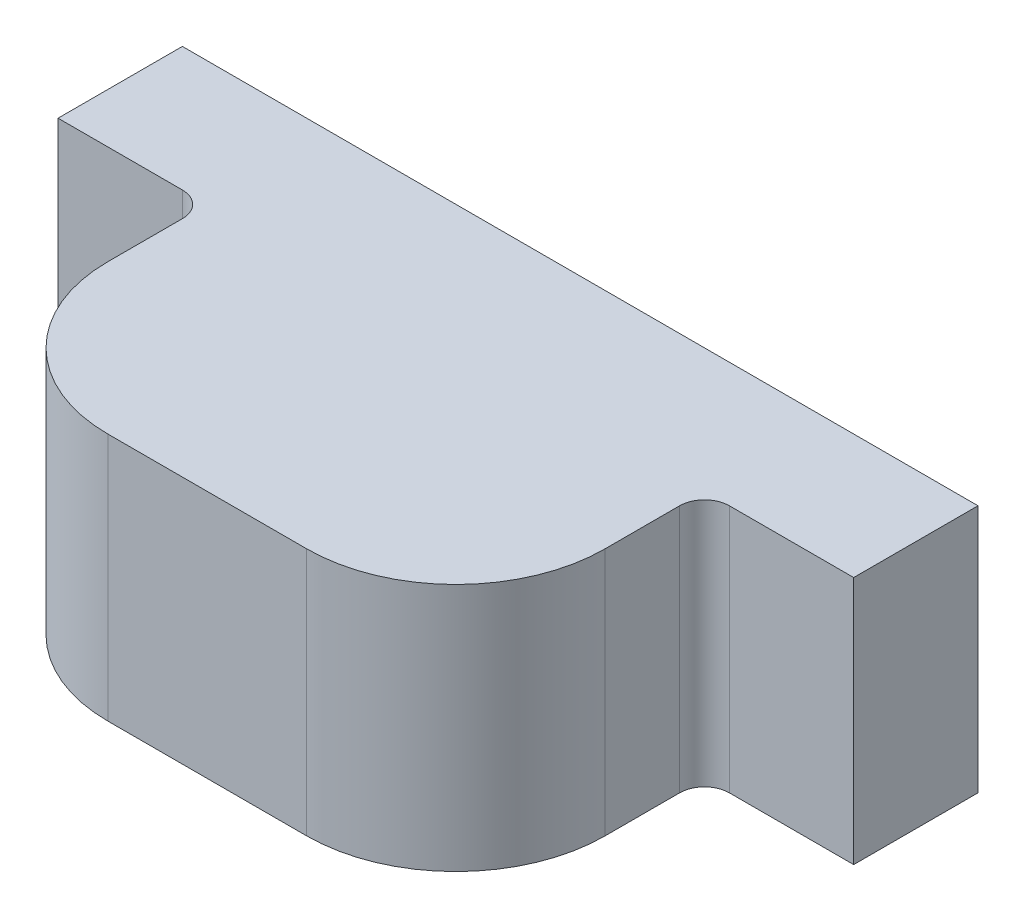
ISO-10303-21;
HEADER;
FILE_DESCRIPTION(('STEP AP214'),'2;1');
FILE_NAME('part.step','',(''),(''),'','','');
FILE_SCHEMA(('AUTOMOTIVE_DESIGN { 1 0 10303 214 1 1 1 1 }'));
ENDSEC;
DATA;
#1=APPLICATION_CONTEXT('core data for automotive mechanical design processes');
#2=APPLICATION_PROTOCOL_DEFINITION('international standard','automotive_design',2000,#1);
#3=PRODUCT_CONTEXT('',#1,'mechanical');
#4=PRODUCT('Part','Part','',(#3));
#5=PRODUCT_RELATED_PRODUCT_CATEGORY('part','',(#4));
#6=PRODUCT_DEFINITION_FORMATION('','',#4);
#7=PRODUCT_DEFINITION_CONTEXT('part definition',#1,'design');
#8=PRODUCT_DEFINITION('design','',#6,#7);
#9=PRODUCT_DEFINITION_SHAPE('','',#8);
#10=(LENGTH_UNIT() NAMED_UNIT(*) SI_UNIT(.MILLI.,.METRE.));
#11=(NAMED_UNIT(*) PLANE_ANGLE_UNIT() SI_UNIT($,.RADIAN.));
#12=(NAMED_UNIT(*) SI_UNIT($,.STERADIAN.) SOLID_ANGLE_UNIT());
#13=UNCERTAINTY_MEASURE_WITH_UNIT(LENGTH_MEASURE(1.E-05),#10,'distance_accuracy_value','');
#14=(GEOMETRIC_REPRESENTATION_CONTEXT(3) GLOBAL_UNCERTAINTY_ASSIGNED_CONTEXT((#13)) GLOBAL_UNIT_ASSIGNED_CONTEXT((#10,
#11,#12)) REPRESENTATION_CONTEXT('',''));
#15=CARTESIAN_POINT('',(0.,0.,0.));
#16=DIRECTION('',(0.,0.,1.));
#17=DIRECTION('',(1.,0.,0.));
#18=AXIS2_PLACEMENT_3D('',#15,#16,#17);
#19=CARTESIAN_POINT('',(-1.6,1.,-0.25));
#20=DIRECTION('',(1.,0.,0.));
#21=DIRECTION('',(0.,0.,-1.));
#22=AXIS2_PLACEMENT_3D('',#19,#20,#21);
#23=PLANE('',#22);
#24=DIRECTION('',(0.,0.,1.));
#25=VECTOR('',#24,1.);
#26=CARTESIAN_POINT('',(-1.6,0.,-0.25));
#27=LINE('',#26,#25);
#28=CARTESIAN_POINT('',(-1.6,0.,-0.25));
#29=VERTEX_POINT('',#28);
#30=CARTESIAN_POINT('',(-1.6,0.,0.25));
#31=VERTEX_POINT('',#30);
#32=EDGE_CURVE('E153',#29,#31,#27,.T.);
#33=ORIENTED_EDGE('',*,*,#32,.T.);
#34=DIRECTION('',(0.,-1.,0.));
#35=VECTOR('',#34,1.);
#36=CARTESIAN_POINT('',(-1.6,1.,0.25));
#37=LINE('',#36,#35);
#38=CARTESIAN_POINT('',(-1.6,1.,0.25));
#39=VERTEX_POINT('',#38);
#40=EDGE_CURVE('E11',#39,#31,#37,.T.);
#41=ORIENTED_EDGE('',*,*,#40,.F.);
#42=DIRECTION('',(0.,0.,1.));
#43=VECTOR('',#42,1.);
#44=CARTESIAN_POINT('',(-1.6,1.,-0.25));
#45=LINE('',#44,#43);
#46=CARTESIAN_POINT('',(-1.6,1.,-0.25));
#47=VERTEX_POINT('',#46);
#48=EDGE_CURVE('E175',#47,#39,#45,.T.);
#49=ORIENTED_EDGE('',*,*,#48,.F.);
#50=DIRECTION('',(0.,-1.,0.));
#51=VECTOR('',#50,1.);
#52=CARTESIAN_POINT('',(-1.6,1.,-0.25));
#53=LINE('',#52,#51);
#54=EDGE_CURVE('E149',#47,#29,#53,.T.);
#55=ORIENTED_EDGE('',*,*,#54,.T.);
#56=EDGE_LOOP('',(#33,#41,#49,#55));
#57=FACE_BOUND('',#56,.T.);
#58=ADVANCED_FACE('F33',(#57),#23,.F.);
#59=CARTESIAN_POINT('',(-1.1,1.,0.25));
#60=DIRECTION('',(0.,0.,-1.));
#61=DIRECTION('',(-1.,0.,0.));
#62=AXIS2_PLACEMENT_3D('',#59,#60,#61);
#63=PLANE('',#62);
#64=DIRECTION('',(1.,0.,0.));
#65=VECTOR('',#64,1.);
#66=CARTESIAN_POINT('',(-1.1,0.,0.25));
#67=LINE('',#66,#65);
#68=CARTESIAN_POINT('',(-1.1,0.,0.25));
#69=VERTEX_POINT('',#68);
#70=EDGE_CURVE('E156',#31,#69,#67,.T.);
#71=ORIENTED_EDGE('',*,*,#70,.T.);
#72=DIRECTION('',(0.,-1.,0.));
#73=VECTOR('',#72,1.);
#74=CARTESIAN_POINT('',(-1.1,1.,0.25));
#75=LINE('',#74,#73);
#76=CARTESIAN_POINT('',(-1.1,1.,0.25));
#77=VERTEX_POINT('',#76);
#78=EDGE_CURVE('E41',#77,#69,#75,.T.);
#79=ORIENTED_EDGE('',*,*,#78,.F.);
#80=DIRECTION('',(1.,0.,0.));
#81=VECTOR('',#80,1.);
#82=CARTESIAN_POINT('',(-1.1,1.,0.25));
#83=LINE('',#82,#81);
#84=EDGE_CURVE('E104',#39,#77,#83,.T.);
#85=ORIENTED_EDGE('',*,*,#84,.F.);
#86=ORIENTED_EDGE('',*,*,#40,.T.);
#87=EDGE_LOOP('',(#71,#79,#85,#86));
#88=FACE_BOUND('',#87,.T.);
#89=ADVANCED_FACE('F253',(#88),#63,.F.);
#90=CARTESIAN_POINT('',(-1.1,1.,0.35));
#91=DIRECTION('',(0.,-1.,0.));
#92=DIRECTION('',(0.,0.,-1.));
#93=AXIS2_PLACEMENT_3D('',#90,#91,#92);
#94=CYLINDRICAL_SURFACE('',#93,0.1);
#95=CARTESIAN_POINT('',(-1.1,0.,0.35));
#96=DIRECTION('',(0.,-1.,0.));
#97=DIRECTION('',(0.,0.,-1.));
#98=AXIS2_PLACEMENT_3D('',#95,#96,#97);
#99=CIRCLE('',#98,0.1);
#100=CARTESIAN_POINT('',(-0.999999999999998,0.,0.350000000000001));
#101=VERTEX_POINT('',#100);
#102=EDGE_CURVE('E158',#69,#101,#99,.T.);
#103=ORIENTED_EDGE('',*,*,#102,.T.);
#104=DIRECTION('',(0.,-1.,0.));
#105=VECTOR('',#104,1.);
#106=CARTESIAN_POINT('',(-0.999999999999998,1.,0.350000000000001));
#107=LINE('',#106,#105);
#108=CARTESIAN_POINT('',(-0.999999999999998,1.,0.350000000000001));
#109=VERTEX_POINT('',#108);
#110=EDGE_CURVE('E194',#109,#101,#107,.T.);
#111=ORIENTED_EDGE('',*,*,#110,.F.);
#112=CARTESIAN_POINT('',(-1.1,1.,0.35));
#113=DIRECTION('',(0.,-1.,0.));
#114=DIRECTION('',(0.,0.,-1.));
#115=AXIS2_PLACEMENT_3D('',#112,#113,#114);
#116=CIRCLE('',#115,0.1);
#117=EDGE_CURVE('E202',#77,#109,#116,.T.);
#118=ORIENTED_EDGE('',*,*,#117,.F.);
#119=ORIENTED_EDGE('',*,*,#78,.T.);
#120=EDGE_LOOP('',(#103,#111,#118,#119));
#121=FACE_BOUND('',#120,.T.);
#122=ADVANCED_FACE('F200',(#121),#94,.F.);
#123=CARTESIAN_POINT('',(-0.999999999999998,1.,0.649999999999996));
#124=DIRECTION('',(1.,0.,0.));
#125=DIRECTION('',(0.,0.,-1.));
#126=AXIS2_PLACEMENT_3D('',#123,#124,#125);
#127=PLANE('',#126);
#128=DIRECTION('',(0.,0.,1.));
#129=VECTOR('',#128,1.);
#130=CARTESIAN_POINT('',(-0.999999999999998,0.,0.649999999999996));
#131=LINE('',#130,#129);
#132=CARTESIAN_POINT('',(-0.999999999999998,0.,0.649999999999996));
#133=VERTEX_POINT('',#132);
#134=EDGE_CURVE('E160',#101,#133,#131,.T.);
#135=ORIENTED_EDGE('',*,*,#134,.T.);
#136=DIRECTION('',(0.,-1.,0.));
#137=VECTOR('',#136,1.);
#138=CARTESIAN_POINT('',(-0.999999999999998,1.,0.649999999999996));
#139=LINE('',#138,#137);
#140=CARTESIAN_POINT('',(-0.999999999999998,1.,0.649999999999996));
#141=VERTEX_POINT('',#140);
#142=EDGE_CURVE('E191',#141,#133,#139,.T.);
#143=ORIENTED_EDGE('',*,*,#142,.F.);
#144=DIRECTION('',(0.,0.,1.));
#145=VECTOR('',#144,1.);
#146=CARTESIAN_POINT('',(-0.999999999999998,1.,0.649999999999996));
#147=LINE('',#146,#145);
#148=EDGE_CURVE('E220',#109,#141,#147,.T.);
#149=ORIENTED_EDGE('',*,*,#148,.F.);
#150=ORIENTED_EDGE('',*,*,#110,.T.);
#151=EDGE_LOOP('',(#135,#143,#149,#150));
#152=FACE_BOUND('',#151,.T.);
#153=ADVANCED_FACE('F211',(#152),#127,.F.);
#154=CARTESIAN_POINT('',(-0.399999999999998,1.,0.65));
#155=DIRECTION('',(0.,-1.,0.));
#156=DIRECTION('',(0.,0.,-1.));
#157=AXIS2_PLACEMENT_3D('',#154,#155,#156);
#158=CYLINDRICAL_SURFACE('',#157,0.6);
#159=CARTESIAN_POINT('',(-0.399999999999998,0.,0.65));
#160=DIRECTION('',(0.,1.,0.));
#161=DIRECTION('',(0.,0.,-1.));
#162=AXIS2_PLACEMENT_3D('',#159,#160,#161);
#163=CIRCLE('',#162,0.6);
#164=CARTESIAN_POINT('',(-0.399999999999994,0.,1.25));
#165=VERTEX_POINT('',#164);
#166=EDGE_CURVE('E162',#133,#165,#163,.T.);
#167=ORIENTED_EDGE('',*,*,#166,.T.);
#168=DIRECTION('',(0.,-1.,0.));
#169=VECTOR('',#168,1.);
#170=CARTESIAN_POINT('',(-0.399999999999994,1.,1.25));
#171=LINE('',#170,#169);
#172=CARTESIAN_POINT('',(-0.399999999999994,1.,1.25));
#173=VERTEX_POINT('',#172);
#174=EDGE_CURVE('E188',#173,#165,#171,.T.);
#175=ORIENTED_EDGE('',*,*,#174,.F.);
#176=CARTESIAN_POINT('',(-0.399999999999998,1.,0.65));
#177=DIRECTION('',(0.,1.,0.));
#178=DIRECTION('',(0.,0.,-1.));
#179=AXIS2_PLACEMENT_3D('',#176,#177,#178);
#180=CIRCLE('',#179,0.6);
#181=EDGE_CURVE('E217',#141,#173,#180,.T.);
#182=ORIENTED_EDGE('',*,*,#181,.F.);
#183=ORIENTED_EDGE('',*,*,#142,.T.);
#184=EDGE_LOOP('',(#167,#175,#182,#183));
#185=FACE_BOUND('',#184,.T.);
#186=ADVANCED_FACE('F215',(#185),#158,.T.);
#187=CARTESIAN_POINT('',(0.399999999999998,1.,1.25));
#188=DIRECTION('',(0.,0.,-1.));
#189=DIRECTION('',(-1.,0.,0.));
#190=AXIS2_PLACEMENT_3D('',#187,#188,#189);
#191=PLANE('',#190);
#192=DIRECTION('',(1.,0.,0.));
#193=VECTOR('',#192,1.);
#194=CARTESIAN_POINT('',(0.399999999999998,0.,1.25));
#195=LINE('',#194,#193);
#196=CARTESIAN_POINT('',(0.399999999999998,0.,1.25));
#197=VERTEX_POINT('',#196);
#198=EDGE_CURVE('E164',#165,#197,#195,.T.);
#199=ORIENTED_EDGE('',*,*,#198,.T.);
#200=DIRECTION('',(0.,-1.,0.));
#201=VECTOR('',#200,1.);
#202=CARTESIAN_POINT('',(0.399999999999998,1.,1.25));
#203=LINE('',#202,#201);
#204=CARTESIAN_POINT('',(0.399999999999998,1.,1.25));
#205=VERTEX_POINT('',#204);
#206=EDGE_CURVE('E185',#205,#197,#203,.T.);
#207=ORIENTED_EDGE('',*,*,#206,.F.);
#208=DIRECTION('',(1.,0.,0.));
#209=VECTOR('',#208,1.);
#210=CARTESIAN_POINT('',(0.399999999999998,1.,1.25));
#211=LINE('',#210,#209);
#212=EDGE_CURVE('E219',#173,#205,#211,.T.);
#213=ORIENTED_EDGE('',*,*,#212,.F.);
#214=ORIENTED_EDGE('',*,*,#174,.T.);
#215=EDGE_LOOP('',(#199,#207,#213,#214));
#216=FACE_BOUND('',#215,.T.);
#217=ADVANCED_FACE('F266',(#216),#191,.F.);
#218=CARTESIAN_POINT('',(0.400000000000002,1.,0.65));
#219=DIRECTION('',(0.,-1.,0.));
#220=DIRECTION('',(0.,0.,-1.));
#221=AXIS2_PLACEMENT_3D('',#218,#219,#220);
#222=CYLINDRICAL_SURFACE('',#221,0.6);
#223=CARTESIAN_POINT('',(0.400000000000002,0.,0.65));
#224=DIRECTION('',(0.,1.,0.));
#225=DIRECTION('',(0.,0.,1.));
#226=AXIS2_PLACEMENT_3D('',#223,#224,#225);
#227=CIRCLE('',#226,0.6);
#228=CARTESIAN_POINT('',(1.,0.,0.649999999999996));
#229=VERTEX_POINT('',#228);
#230=EDGE_CURVE('E166',#197,#229,#227,.T.);
#231=ORIENTED_EDGE('',*,*,#230,.T.);
#232=DIRECTION('',(0.,-1.,0.));
#233=VECTOR('',#232,1.);
#234=CARTESIAN_POINT('',(1.,1.,0.649999999999996));
#235=LINE('',#234,#233);
#236=CARTESIAN_POINT('',(1.,1.,0.649999999999996));
#237=VERTEX_POINT('',#236);
#238=EDGE_CURVE('E182',#237,#229,#235,.T.);
#239=ORIENTED_EDGE('',*,*,#238,.F.);
#240=CARTESIAN_POINT('',(0.400000000000002,1.,0.65));
#241=DIRECTION('',(0.,1.,0.));
#242=DIRECTION('',(0.,0.,1.));
#243=AXIS2_PLACEMENT_3D('',#240,#241,#242);
#244=CIRCLE('',#243,0.6);
#245=EDGE_CURVE('E222',#205,#237,#244,.T.);
#246=ORIENTED_EDGE('',*,*,#245,.F.);
#247=ORIENTED_EDGE('',*,*,#206,.T.);
#248=EDGE_LOOP('',(#231,#239,#246,#247));
#249=FACE_BOUND('',#248,.T.);
#250=ADVANCED_FACE('F269',(#249),#222,.T.);
#251=CARTESIAN_POINT('',(1.,1.,0.649999999999996));
#252=DIRECTION('',(-1.,0.,0.));
#253=DIRECTION('',(0.,0.,1.));
#254=AXIS2_PLACEMENT_3D('',#251,#252,#253);
#255=PLANE('',#254);
#256=DIRECTION('',(0.,0.,-1.));
#257=VECTOR('',#256,1.);
#258=CARTESIAN_POINT('',(1.,0.,0.649999999999996));
#259=LINE('',#258,#257);
#260=CARTESIAN_POINT('',(1.,0.,0.350000000000001));
#261=VERTEX_POINT('',#260);
#262=EDGE_CURVE('E168',#229,#261,#259,.T.);
#263=ORIENTED_EDGE('',*,*,#262,.T.);
#264=DIRECTION('',(0.,-1.,0.));
#265=VECTOR('',#264,1.);
#266=CARTESIAN_POINT('',(1.,1.,0.350000000000001));
#267=LINE('',#266,#265);
#268=CARTESIAN_POINT('',(1.,1.,0.350000000000001));
#269=VERTEX_POINT('',#268);
#270=EDGE_CURVE('E179',#269,#261,#267,.T.);
#271=ORIENTED_EDGE('',*,*,#270,.F.);
#272=DIRECTION('',(0.,0.,-1.));
#273=VECTOR('',#272,1.);
#274=CARTESIAN_POINT('',(1.,1.,0.649999999999996));
#275=LINE('',#274,#273);
#276=EDGE_CURVE('E228',#237,#269,#275,.T.);
#277=ORIENTED_EDGE('',*,*,#276,.F.);
#278=ORIENTED_EDGE('',*,*,#238,.T.);
#279=EDGE_LOOP('',(#263,#271,#277,#278));
#280=FACE_BOUND('',#279,.T.);
#281=ADVANCED_FACE('F234',(#280),#255,.F.);
#282=CARTESIAN_POINT('',(1.1,1.,0.35));
#283=DIRECTION('',(0.,-1.,0.));
#284=DIRECTION('',(0.,0.,-1.));
#285=AXIS2_PLACEMENT_3D('',#282,#283,#284);
#286=CYLINDRICAL_SURFACE('',#285,0.1);
#287=CARTESIAN_POINT('',(1.1,0.,0.35));
#288=DIRECTION('',(0.,-1.,0.));
#289=DIRECTION('',(0.,0.,-1.));
#290=AXIS2_PLACEMENT_3D('',#287,#288,#289);
#291=CIRCLE('',#290,0.1);
#292=CARTESIAN_POINT('',(1.1,0.,0.25));
#293=VERTEX_POINT('',#292);
#294=EDGE_CURVE('E170',#261,#293,#291,.T.);
#295=ORIENTED_EDGE('',*,*,#294,.T.);
#296=DIRECTION('',(0.,-1.,0.));
#297=VECTOR('',#296,1.);
#298=CARTESIAN_POINT('',(1.1,1.,0.25));
#299=LINE('',#298,#297);
#300=CARTESIAN_POINT('',(1.1,1.,0.25));
#301=VERTEX_POINT('',#300);
#302=EDGE_CURVE('E144',#301,#293,#299,.T.);
#303=ORIENTED_EDGE('',*,*,#302,.F.);
#304=CARTESIAN_POINT('',(1.1,1.,0.35));
#305=DIRECTION('',(0.,-1.,0.));
#306=DIRECTION('',(0.,0.,-1.));
#307=AXIS2_PLACEMENT_3D('',#304,#305,#306);
#308=CIRCLE('',#307,0.1);
#309=EDGE_CURVE('E135',#269,#301,#308,.T.);
#310=ORIENTED_EDGE('',*,*,#309,.F.);
#311=ORIENTED_EDGE('',*,*,#270,.T.);
#312=EDGE_LOOP('',(#295,#303,#310,#311));
#313=FACE_BOUND('',#312,.T.);
#314=ADVANCED_FACE('F238',(#313),#286,.F.);
#315=CARTESIAN_POINT('',(1.6,1.,0.25));
#316=DIRECTION('',(0.,0.,-1.));
#317=DIRECTION('',(-1.,0.,0.));
#318=AXIS2_PLACEMENT_3D('',#315,#316,#317);
#319=PLANE('',#318);
#320=DIRECTION('',(1.,0.,0.));
#321=VECTOR('',#320,1.);
#322=CARTESIAN_POINT('',(1.6,0.,0.25));
#323=LINE('',#322,#321);
#324=CARTESIAN_POINT('',(1.6,0.,0.25));
#325=VERTEX_POINT('',#324);
#326=EDGE_CURVE('E143',#293,#325,#323,.T.);
#327=ORIENTED_EDGE('',*,*,#326,.T.);
#328=DIRECTION('',(0.,-1.,0.));
#329=VECTOR('',#328,1.);
#330=CARTESIAN_POINT('',(1.6,1.,0.25));
#331=LINE('',#330,#329);
#332=CARTESIAN_POINT('',(1.6,1.,0.25));
#333=VERTEX_POINT('',#332);
#334=EDGE_CURVE('E140',#333,#325,#331,.T.);
#335=ORIENTED_EDGE('',*,*,#334,.F.);
#336=DIRECTION('',(1.,0.,0.));
#337=VECTOR('',#336,1.);
#338=CARTESIAN_POINT('',(1.6,1.,0.25));
#339=LINE('',#338,#337);
#340=EDGE_CURVE('E129',#301,#333,#339,.T.);
#341=ORIENTED_EDGE('',*,*,#340,.F.);
#342=ORIENTED_EDGE('',*,*,#302,.T.);
#343=EDGE_LOOP('',(#327,#335,#341,#342));
#344=FACE_BOUND('',#343,.T.);
#345=ADVANCED_FACE('F141',(#344),#319,.F.);
#346=CARTESIAN_POINT('',(1.6,1.,-0.25));
#347=DIRECTION('',(-1.,0.,0.));
#348=DIRECTION('',(0.,0.,1.));
#349=AXIS2_PLACEMENT_3D('',#346,#347,#348);
#350=PLANE('',#349);
#351=DIRECTION('',(0.,0.,-1.));
#352=VECTOR('',#351,1.);
#353=CARTESIAN_POINT('',(1.6,0.,-0.25));
#354=LINE('',#353,#352);
#355=CARTESIAN_POINT('',(1.6,0.,-0.25));
#356=VERTEX_POINT('',#355);
#357=EDGE_CURVE('E90',#325,#356,#354,.T.);
#358=ORIENTED_EDGE('',*,*,#357,.T.);
#359=DIRECTION('',(0.,-1.,0.));
#360=VECTOR('',#359,1.);
#361=CARTESIAN_POINT('',(1.6,1.,-0.25));
#362=LINE('',#361,#360);
#363=CARTESIAN_POINT('',(1.6,1.,-0.25));
#364=VERTEX_POINT('',#363);
#365=EDGE_CURVE('E145',#364,#356,#362,.T.);
#366=ORIENTED_EDGE('',*,*,#365,.F.);
#367=DIRECTION('',(0.,0.,-1.));
#368=VECTOR('',#367,1.);
#369=CARTESIAN_POINT('',(1.6,1.,-0.25));
#370=LINE('',#369,#368);
#371=EDGE_CURVE('E133',#333,#364,#370,.T.);
#372=ORIENTED_EDGE('',*,*,#371,.F.);
#373=ORIENTED_EDGE('',*,*,#334,.T.);
#374=EDGE_LOOP('',(#358,#366,#372,#373));
#375=FACE_BOUND('',#374,.T.);
#376=ADVANCED_FACE('F147',(#375),#350,.F.);
#377=CARTESIAN_POINT('',(1.6,1.,-0.25));
#378=DIRECTION('',(0.,0.,1.));
#379=DIRECTION('',(1.,0.,0.));
#380=AXIS2_PLACEMENT_3D('',#377,#378,#379);
#381=PLANE('',#380);
#382=DIRECTION('',(-1.,0.,0.));
#383=VECTOR('',#382,1.);
#384=CARTESIAN_POINT('',(1.6,0.,-0.25));
#385=LINE('',#384,#383);
#386=EDGE_CURVE('E96',#356,#29,#385,.T.);
#387=ORIENTED_EDGE('',*,*,#386,.T.);
#388=ORIENTED_EDGE('',*,*,#54,.F.);
#389=DIRECTION('',(-1.,0.,0.));
#390=VECTOR('',#389,1.);
#391=CARTESIAN_POINT('',(1.6,1.,-0.25));
#392=LINE('',#391,#390);
#393=EDGE_CURVE('E49',#364,#47,#392,.T.);
#394=ORIENTED_EDGE('',*,*,#393,.F.);
#395=ORIENTED_EDGE('',*,*,#365,.T.);
#396=EDGE_LOOP('',(#387,#388,#394,#395));
#397=FACE_BOUND('',#396,.T.);
#398=ADVANCED_FACE('F242',(#397),#381,.F.);
#399=CARTESIAN_POINT('',(-1.1,1.,0.35));
#400=DIRECTION('',(0.,-1.,0.));
#401=DIRECTION('',(0.,0.,-1.));
#402=AXIS2_PLACEMENT_3D('',#399,#400,#401);
#403=PLANE('',#402);
#404=ORIENTED_EDGE('',*,*,#48,.T.);
#405=ORIENTED_EDGE('',*,*,#84,.T.);
#406=ORIENTED_EDGE('',*,*,#117,.T.);
#407=ORIENTED_EDGE('',*,*,#148,.T.);
#408=ORIENTED_EDGE('',*,*,#181,.T.);
#409=ORIENTED_EDGE('',*,*,#212,.T.);
#410=ORIENTED_EDGE('',*,*,#245,.T.);
#411=ORIENTED_EDGE('',*,*,#276,.T.);
#412=ORIENTED_EDGE('',*,*,#309,.T.);
#413=ORIENTED_EDGE('',*,*,#340,.T.);
#414=ORIENTED_EDGE('',*,*,#371,.T.);
#415=ORIENTED_EDGE('',*,*,#393,.T.);
#416=EDGE_LOOP('',(#404,#405,#406,#407,#408,#409,#410,#411,#412,#413,#414,#415));
#417=FACE_BOUND('',#416,.T.);
#418=ADVANCED_FACE('F131',(#417),#403,.F.);
#419=CARTESIAN_POINT('',(-1.1,0.,0.35));
#420=DIRECTION('',(0.,-1.,0.));
#421=DIRECTION('',(0.,0.,-1.));
#422=AXIS2_PLACEMENT_3D('',#419,#420,#421);
#423=PLANE('',#422);
#424=ORIENTED_EDGE('',*,*,#32,.F.);
#425=ORIENTED_EDGE('',*,*,#386,.F.);
#426=ORIENTED_EDGE('',*,*,#357,.F.);
#427=ORIENTED_EDGE('',*,*,#326,.F.);
#428=ORIENTED_EDGE('',*,*,#294,.F.);
#429=ORIENTED_EDGE('',*,*,#262,.F.);
#430=ORIENTED_EDGE('',*,*,#230,.F.);
#431=ORIENTED_EDGE('',*,*,#198,.F.);
#432=ORIENTED_EDGE('',*,*,#166,.F.);
#433=ORIENTED_EDGE('',*,*,#134,.F.);
#434=ORIENTED_EDGE('',*,*,#102,.F.);
#435=ORIENTED_EDGE('',*,*,#70,.F.);
#436=EDGE_LOOP('',(#424,#425,#426,#427,#428,#429,#430,#431,#432,#433,#434,#435));
#437=FACE_BOUND('',#436,.T.);
#438=ADVANCED_FACE('F206',(#437),#423,.T.);
#439=CLOSED_SHELL('',(#58,#89,#122,#153,#186,#217,#250,#281,#314,#345,#376,#398,#418,#438));
#440=MANIFOLD_SOLID_BREP('B2',#439);
#441=ADVANCED_BREP_SHAPE_REPRESENTATION('',(#18,#440),#14);
#442=SHAPE_DEFINITION_REPRESENTATION(#9,#441);
ENDSEC;
END-ISO-10303-21;
